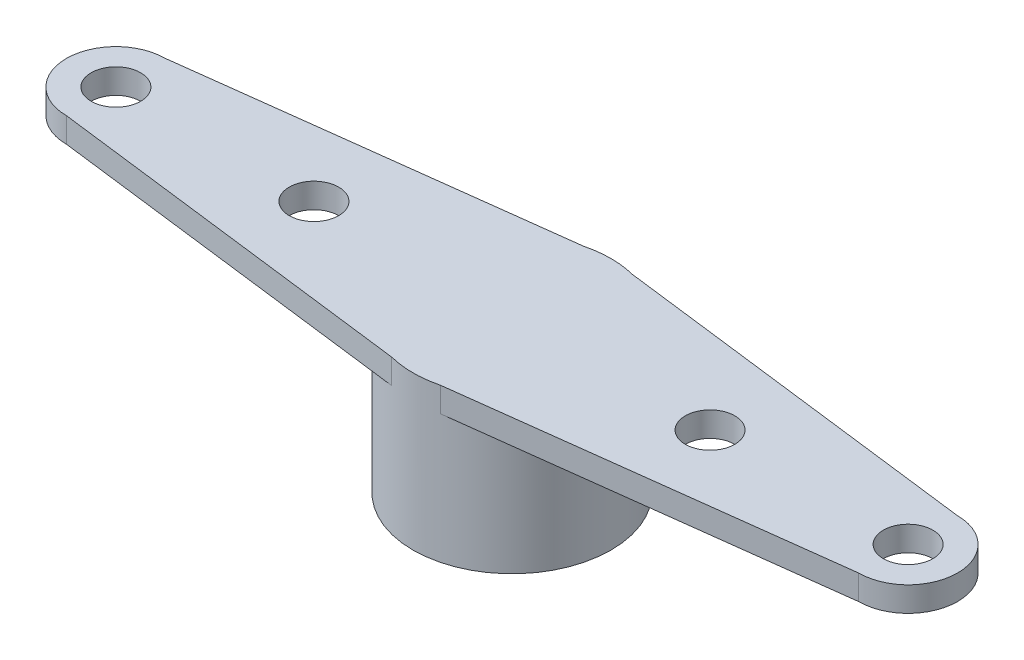
ISO-10303-21;
HEADER;
FILE_DESCRIPTION(('STEP AP214'),'2;1');
FILE_NAME('part.step','',(''),(''),'','','');
FILE_SCHEMA(('AUTOMOTIVE_DESIGN { 1 0 10303 214 1 1 1 1 }'));
ENDSEC;
DATA;
#1=APPLICATION_CONTEXT('core data for automotive mechanical design processes');
#2=APPLICATION_PROTOCOL_DEFINITION('international standard','automotive_design',2000,#1);
#3=PRODUCT_CONTEXT('',#1,'mechanical');
#4=PRODUCT('Part','Part','',(#3));
#5=PRODUCT_RELATED_PRODUCT_CATEGORY('part','',(#4));
#6=PRODUCT_DEFINITION_FORMATION('','',#4);
#7=PRODUCT_DEFINITION_CONTEXT('part definition',#1,'design');
#8=PRODUCT_DEFINITION('design','',#6,#7);
#9=PRODUCT_DEFINITION_SHAPE('','',#8);
#10=(LENGTH_UNIT() NAMED_UNIT(*) SI_UNIT(.MILLI.,.METRE.));
#11=(NAMED_UNIT(*) PLANE_ANGLE_UNIT() SI_UNIT($,.RADIAN.));
#12=(NAMED_UNIT(*) SI_UNIT($,.STERADIAN.) SOLID_ANGLE_UNIT());
#13=UNCERTAINTY_MEASURE_WITH_UNIT(LENGTH_MEASURE(1.E-05),#10,'distance_accuracy_value','');
#14=(GEOMETRIC_REPRESENTATION_CONTEXT(3) GLOBAL_UNCERTAINTY_ASSIGNED_CONTEXT((#13)) GLOBAL_UNIT_ASSIGNED_CONTEXT((#10,
#11,#12)) REPRESENTATION_CONTEXT('',''));
#15=CARTESIAN_POINT('',(0.,0.,0.));
#16=DIRECTION('',(0.,0.,1.));
#17=DIRECTION('',(1.,0.,0.));
#18=AXIS2_PLACEMENT_3D('',#15,#16,#17);
#19=CARTESIAN_POINT('',(0.,0.,0.));
#20=DIRECTION('',(0.,1.,0.));
#21=DIRECTION('',(0.,0.,1.));
#22=AXIS2_PLACEMENT_3D('',#19,#20,#21);
#23=PLANE('',#22);
#24=CARTESIAN_POINT('',(5.08,0.,0.));
#25=DIRECTION('',(0.,1.,0.));
#26=DIRECTION('',(0.,0.,1.));
#27=AXIS2_PLACEMENT_3D('',#24,#25,#26);
#28=CIRCLE('',#27,0.635);
#29=CARTESIAN_POINT('',(5.08,0.,0.635));
#30=VERTEX_POINT('',#29);
#31=EDGE_CURVE('E184',#30,#30,#28,.T.);
#32=ORIENTED_EDGE('',*,*,#31,.T.);
#33=EDGE_LOOP('',(#32));
#34=FACE_BOUND('',#33,.T.);
#35=CARTESIAN_POINT('',(10.16,0.,0.));
#36=DIRECTION('',(0.,1.,0.));
#37=DIRECTION('',(0.,0.,1.));
#38=AXIS2_PLACEMENT_3D('',#35,#36,#37);
#39=CIRCLE('',#38,0.635000000000001);
#40=CARTESIAN_POINT('',(10.16,0.,0.635000000000001));
#41=VERTEX_POINT('',#40);
#42=EDGE_CURVE('E178',#41,#41,#39,.T.);
#43=ORIENTED_EDGE('',*,*,#42,.T.);
#44=EDGE_LOOP('',(#43));
#45=FACE_BOUND('',#44,.T.);
#46=CARTESIAN_POINT('',(0.,0.,0.));
#47=DIRECTION('',(0.,-1.,0.));
#48=DIRECTION('',(0.,0.,-1.));
#49=AXIS2_PLACEMENT_3D('',#46,#47,#48);
#50=CIRCLE('',#49,2.54);
#51=CARTESIAN_POINT('',(0.625230769230772,0.,-2.46184615384615));
#52=VERTEX_POINT('',#51);
#53=CARTESIAN_POINT('',(0.625230769230784,0.,2.46184615384615));
#54=VERTEX_POINT('',#53);
#55=EDGE_CURVE('E44',#52,#54,#50,.T.);
#56=ORIENTED_EDGE('',*,*,#55,.F.);
#57=DIRECTION('',(-0.992277876713668,0.,-0.124034734589208));
#58=VECTOR('',#57,1.);
#59=CARTESIAN_POINT('',(10.16,0.,-1.27));
#60=LINE('',#59,#58);
#61=CARTESIAN_POINT('',(10.16,0.,-1.26999999999998));
#62=VERTEX_POINT('',#61);
#63=EDGE_CURVE('E128',#62,#52,#60,.T.);
#64=ORIENTED_EDGE('',*,*,#63,.F.);
#65=CARTESIAN_POINT('',(10.16,0.,0.));
#66=DIRECTION('',(0.,1.,0.));
#67=DIRECTION('',(0.,0.,1.));
#68=AXIS2_PLACEMENT_3D('',#65,#66,#67);
#69=CIRCLE('',#68,1.26999999999998);
#70=CARTESIAN_POINT('',(10.16,0.,1.26999999999997));
#71=VERTEX_POINT('',#70);
#72=EDGE_CURVE('E125',#71,#62,#69,.T.);
#73=ORIENTED_EDGE('',*,*,#72,.F.);
#74=DIRECTION('',(0.992277876713667,0.,-0.124034734589212));
#75=VECTOR('',#74,1.);
#76=CARTESIAN_POINT('',(10.16,0.,1.26999999999997));
#77=LINE('',#76,#75);
#78=EDGE_CURVE('E123',#54,#71,#77,.T.);
#79=ORIENTED_EDGE('',*,*,#78,.F.);
#80=EDGE_LOOP('',(#56,#64,#73,#79));
#81=FACE_BOUND('',#80,.T.);
#82=ADVANCED_FACE('F33',(#34,#45,#81),#23,.F.);
#83=CARTESIAN_POINT('',(-5.08,0.,0.));
#84=DIRECTION('',(0.,1.,0.));
#85=DIRECTION('',(0.,0.,-1.));
#86=AXIS2_PLACEMENT_3D('',#83,#84,#85);
#87=CIRCLE('',#86,0.635);
#88=CARTESIAN_POINT('',(-5.08,0.,-0.635));
#89=VERTEX_POINT('',#88);
#90=EDGE_CURVE('E196',#89,#89,#87,.T.);
#91=ORIENTED_EDGE('',*,*,#90,.T.);
#92=EDGE_LOOP('',(#91));
#93=FACE_BOUND('',#92,.T.);
#94=CARTESIAN_POINT('',(-10.16,0.,0.));
#95=DIRECTION('',(0.,1.,0.));
#96=DIRECTION('',(0.,0.,-1.));
#97=AXIS2_PLACEMENT_3D('',#94,#95,#96);
#98=CIRCLE('',#97,0.635000000000001);
#99=CARTESIAN_POINT('',(-10.16,0.,-0.635000000000001));
#100=VERTEX_POINT('',#99);
#101=EDGE_CURVE('E190',#100,#100,#98,.T.);
#102=ORIENTED_EDGE('',*,*,#101,.T.);
#103=EDGE_LOOP('',(#102));
#104=FACE_BOUND('',#103,.T.);
#105=CARTESIAN_POINT('',(-0.625230769230784,0.,2.46184615384615));
#106=VERTEX_POINT('',#105);
#107=CARTESIAN_POINT('',(-0.625230769230771,0.,-2.46184615384615));
#108=VERTEX_POINT('',#107);
#109=EDGE_CURVE('E11',#106,#108,#50,.T.);
#110=ORIENTED_EDGE('',*,*,#109,.F.);
#111=DIRECTION('',(0.992277876713667,0.,0.124034734589212));
#112=VECTOR('',#111,1.);
#113=CARTESIAN_POINT('',(-10.16,0.,1.26999999999997));
#114=LINE('',#113,#112);
#115=CARTESIAN_POINT('',(-10.16,0.,1.26999999999998));
#116=VERTEX_POINT('',#115);
#117=EDGE_CURVE('E133',#116,#106,#114,.T.);
#118=ORIENTED_EDGE('',*,*,#117,.F.);
#119=CARTESIAN_POINT('',(-10.16,0.,0.));
#120=DIRECTION('',(0.,1.,0.));
#121=DIRECTION('',(0.,0.,-1.));
#122=AXIS2_PLACEMENT_3D('',#119,#120,#121);
#123=CIRCLE('',#122,1.26999999999998);
#124=CARTESIAN_POINT('',(-10.16,0.,-1.27));
#125=VERTEX_POINT('',#124);
#126=EDGE_CURVE('E79',#125,#116,#123,.T.);
#127=ORIENTED_EDGE('',*,*,#126,.F.);
#128=DIRECTION('',(-0.992277876713668,0.,0.124034734589208));
#129=VECTOR('',#128,1.);
#130=CARTESIAN_POINT('',(-10.16,0.,-1.27));
#131=LINE('',#130,#129);
#132=EDGE_CURVE('E72',#108,#125,#131,.T.);
#133=ORIENTED_EDGE('',*,*,#132,.F.);
#134=EDGE_LOOP('',(#110,#118,#127,#133));
#135=FACE_BOUND('',#134,.T.);
#136=ADVANCED_FACE('F232',(#93,#104,#135),#23,.F.);
#137=CARTESIAN_POINT('',(0.,0.635,0.));
#138=DIRECTION('',(0.,1.,0.));
#139=DIRECTION('',(0.,0.,1.));
#140=AXIS2_PLACEMENT_3D('',#137,#138,#139);
#141=PLANE('',#140);
#142=CARTESIAN_POINT('',(-10.16,0.635,0.));
#143=DIRECTION('',(0.,1.,0.));
#144=DIRECTION('',(0.,0.,-1.));
#145=AXIS2_PLACEMENT_3D('',#142,#143,#144);
#146=CIRCLE('',#145,0.635000000000001);
#147=CARTESIAN_POINT('',(-10.16,0.635,-0.635000000000001));
#148=VERTEX_POINT('',#147);
#149=EDGE_CURVE('E187',#148,#148,#146,.T.);
#150=ORIENTED_EDGE('',*,*,#149,.F.);
#151=EDGE_LOOP('',(#150));
#152=FACE_BOUND('',#151,.T.);
#153=CARTESIAN_POINT('',(10.16,0.635,0.));
#154=DIRECTION('',(0.,1.,0.));
#155=DIRECTION('',(0.,0.,1.));
#156=AXIS2_PLACEMENT_3D('',#153,#154,#155);
#157=CIRCLE('',#156,0.635000000000001);
#158=CARTESIAN_POINT('',(10.16,0.635,0.635000000000001));
#159=VERTEX_POINT('',#158);
#160=EDGE_CURVE('E126',#159,#159,#157,.T.);
#161=ORIENTED_EDGE('',*,*,#160,.F.);
#162=EDGE_LOOP('',(#161));
#163=FACE_BOUND('',#162,.T.);
#164=CARTESIAN_POINT('',(0.,0.635,0.));
#165=DIRECTION('',(0.,1.,0.));
#166=DIRECTION('',(0.,0.,1.));
#167=AXIS2_PLACEMENT_3D('',#164,#165,#166);
#168=CIRCLE('',#167,2.54);
#169=CARTESIAN_POINT('',(-0.625230769230784,0.635,2.46184615384615));
#170=VERTEX_POINT('',#169);
#171=CARTESIAN_POINT('',(0.625230769230784,0.635,2.46184615384615));
#172=VERTEX_POINT('',#171);
#173=EDGE_CURVE('E136',#170,#172,#168,.T.);
#174=ORIENTED_EDGE('',*,*,#173,.T.);
#175=DIRECTION('',(0.992277876713667,0.,-0.124034734589212));
#176=VECTOR('',#175,1.);
#177=CARTESIAN_POINT('',(10.16,0.635,1.26999999999997));
#178=LINE('',#177,#176);
#179=CARTESIAN_POINT('',(10.16,0.635,1.26999999999997));
#180=VERTEX_POINT('',#179);
#181=EDGE_CURVE('E88',#172,#180,#178,.T.);
#182=ORIENTED_EDGE('',*,*,#181,.T.);
#183=CARTESIAN_POINT('',(10.16,0.635,0.));
#184=DIRECTION('',(0.,1.,0.));
#185=DIRECTION('',(0.,0.,1.));
#186=AXIS2_PLACEMENT_3D('',#183,#184,#185);
#187=CIRCLE('',#186,1.26999999999998);
#188=CARTESIAN_POINT('',(10.16,0.635,-1.26999999999998));
#189=VERTEX_POINT('',#188);
#190=EDGE_CURVE('E172',#180,#189,#187,.T.);
#191=ORIENTED_EDGE('',*,*,#190,.T.);
#192=DIRECTION('',(-0.992277876713668,0.,-0.124034734589208));
#193=VECTOR('',#192,1.);
#194=CARTESIAN_POINT('',(10.16,0.635,-1.27));
#195=LINE('',#194,#193);
#196=CARTESIAN_POINT('',(0.625230769230772,0.635,-2.46184615384615));
#197=VERTEX_POINT('',#196);
#198=EDGE_CURVE('E171',#189,#197,#195,.T.);
#199=ORIENTED_EDGE('',*,*,#198,.T.);
#200=CARTESIAN_POINT('',(0.,0.635,0.));
#201=DIRECTION('',(0.,1.,0.));
#202=DIRECTION('',(0.,0.,1.));
#203=AXIS2_PLACEMENT_3D('',#200,#201,#202);
#204=CIRCLE('',#203,2.54);
#205=CARTESIAN_POINT('',(-0.625230769230771,0.635,-2.46184615384615));
#206=VERTEX_POINT('',#205);
#207=EDGE_CURVE('E109',#197,#206,#204,.T.);
#208=ORIENTED_EDGE('',*,*,#207,.T.);
#209=DIRECTION('',(-0.992277876713668,0.,0.124034734589208));
#210=VECTOR('',#209,1.);
#211=CARTESIAN_POINT('',(-10.16,0.635,-1.27));
#212=LINE('',#211,#210);
#213=CARTESIAN_POINT('',(-10.16,0.635,-1.27));
#214=VERTEX_POINT('',#213);
#215=EDGE_CURVE('E103',#206,#214,#212,.T.);
#216=ORIENTED_EDGE('',*,*,#215,.T.);
#217=CARTESIAN_POINT('',(-10.16,0.635,0.));
#218=DIRECTION('',(0.,1.,0.));
#219=DIRECTION('',(0.,0.,-1.));
#220=AXIS2_PLACEMENT_3D('',#217,#218,#219);
#221=CIRCLE('',#220,1.26999999999998);
#222=CARTESIAN_POINT('',(-10.16,0.635,1.26999999999998));
#223=VERTEX_POINT('',#222);
#224=EDGE_CURVE('E107',#214,#223,#221,.T.);
#225=ORIENTED_EDGE('',*,*,#224,.T.);
#226=DIRECTION('',(0.992277876713667,0.,0.124034734589212));
#227=VECTOR('',#226,1.);
#228=CARTESIAN_POINT('',(-10.16,0.635,1.26999999999997));
#229=LINE('',#228,#227);
#230=EDGE_CURVE('E52',#223,#170,#229,.T.);
#231=ORIENTED_EDGE('',*,*,#230,.T.);
#232=EDGE_LOOP('',(#174,#182,#191,#199,#208,#216,#225,#231));
#233=FACE_BOUND('',#232,.T.);
#234=CARTESIAN_POINT('',(5.08,0.635,0.));
#235=DIRECTION('',(0.,1.,0.));
#236=DIRECTION('',(0.,0.,1.));
#237=AXIS2_PLACEMENT_3D('',#234,#235,#236);
#238=CIRCLE('',#237,0.635);
#239=CARTESIAN_POINT('',(5.08,0.635,0.635));
#240=VERTEX_POINT('',#239);
#241=EDGE_CURVE('E181',#240,#240,#238,.T.);
#242=ORIENTED_EDGE('',*,*,#241,.F.);
#243=EDGE_LOOP('',(#242));
#244=FACE_BOUND('',#243,.T.);
#245=CARTESIAN_POINT('',(-5.08,0.635,0.));
#246=DIRECTION('',(0.,1.,0.));
#247=DIRECTION('',(0.,0.,-1.));
#248=AXIS2_PLACEMENT_3D('',#245,#246,#247);
#249=CIRCLE('',#248,0.635);
#250=CARTESIAN_POINT('',(-5.08,0.635,-0.635));
#251=VERTEX_POINT('',#250);
#252=EDGE_CURVE('E193',#251,#251,#249,.T.);
#253=ORIENTED_EDGE('',*,*,#252,.F.);
#254=EDGE_LOOP('',(#253));
#255=FACE_BOUND('',#254,.T.);
#256=ADVANCED_FACE('F104',(#152,#163,#233,#244,#255),#141,.T.);
#257=CARTESIAN_POINT('',(10.16,0.635,1.26999999999997));
#258=DIRECTION('',(-0.124034734589212,0.,-0.992277876713667));
#259=DIRECTION('',(-0.992277876713667,0.,0.124034734589212));
#260=AXIS2_PLACEMENT_3D('',#257,#258,#259);
#261=PLANE('',#260);
#262=ORIENTED_EDGE('',*,*,#78,.T.);
#263=DIRECTION('',(0.,-1.,0.));
#264=VECTOR('',#263,1.);
#265=CARTESIAN_POINT('',(10.16,0.635,1.26999999999997));
#266=LINE('',#265,#264);
#267=EDGE_CURVE('E146',#180,#71,#266,.T.);
#268=ORIENTED_EDGE('',*,*,#267,.F.);
#269=ORIENTED_EDGE('',*,*,#181,.F.);
#270=DIRECTION('',(0.,-1.,0.));
#271=VECTOR('',#270,1.);
#272=CARTESIAN_POINT('',(0.625230769230784,0.635,2.46184615384615));
#273=LINE('',#272,#271);
#274=EDGE_CURVE('E37',#172,#54,#273,.T.);
#275=ORIENTED_EDGE('',*,*,#274,.T.);
#276=EDGE_LOOP('',(#262,#268,#269,#275));
#277=FACE_BOUND('',#276,.T.);
#278=ADVANCED_FACE('F35',(#277),#261,.F.);
#279=CARTESIAN_POINT('',(10.16,0.635,0.));
#280=DIRECTION('',(0.,-1.,0.));
#281=DIRECTION('',(0.,0.,-1.));
#282=AXIS2_PLACEMENT_3D('',#279,#280,#281);
#283=CYLINDRICAL_SURFACE('',#282,1.26999999999998);
#284=ORIENTED_EDGE('',*,*,#72,.T.);
#285=DIRECTION('',(0.,-1.,0.));
#286=VECTOR('',#285,1.);
#287=CARTESIAN_POINT('',(10.16,0.635,-1.26999999999998));
#288=LINE('',#287,#286);
#289=EDGE_CURVE('E144',#189,#62,#288,.T.);
#290=ORIENTED_EDGE('',*,*,#289,.F.);
#291=ORIENTED_EDGE('',*,*,#190,.F.);
#292=ORIENTED_EDGE('',*,*,#267,.T.);
#293=EDGE_LOOP('',(#284,#290,#291,#292));
#294=FACE_BOUND('',#293,.T.);
#295=ADVANCED_FACE('F167',(#294),#283,.T.);
#296=CARTESIAN_POINT('',(10.16,0.635,-1.27));
#297=DIRECTION('',(-0.124034734589208,0.,0.992277876713668));
#298=DIRECTION('',(0.992277876713668,0.,0.124034734589208));
#299=AXIS2_PLACEMENT_3D('',#296,#297,#298);
#300=PLANE('',#299);
#301=ORIENTED_EDGE('',*,*,#63,.T.);
#302=DIRECTION('',(0.,-1.,0.));
#303=VECTOR('',#302,1.);
#304=CARTESIAN_POINT('',(0.625230769230772,0.635,-2.46184615384615));
#305=LINE('',#304,#303);
#306=EDGE_CURVE('E141',#197,#52,#305,.T.);
#307=ORIENTED_EDGE('',*,*,#306,.F.);
#308=ORIENTED_EDGE('',*,*,#198,.F.);
#309=ORIENTED_EDGE('',*,*,#289,.T.);
#310=EDGE_LOOP('',(#301,#307,#308,#309));
#311=FACE_BOUND('',#310,.T.);
#312=ADVANCED_FACE('F170',(#311),#300,.F.);
#313=CARTESIAN_POINT('',(0.,0.635,0.));
#314=DIRECTION('',(0.,-1.,0.));
#315=DIRECTION('',(0.,0.,-1.));
#316=AXIS2_PLACEMENT_3D('',#313,#314,#315);
#317=CYLINDRICAL_SURFACE('',#316,2.54);
#318=ORIENTED_EDGE('',*,*,#306,.T.);
#319=ORIENTED_EDGE('',*,*,#55,.T.);
#320=ORIENTED_EDGE('',*,*,#274,.F.);
#321=ORIENTED_EDGE('',*,*,#173,.F.);
#322=DIRECTION('',(0.,-1.,0.));
#323=VECTOR('',#322,1.);
#324=CARTESIAN_POINT('',(-0.625230769230784,0.635,2.46184615384615));
#325=LINE('',#324,#323);
#326=EDGE_CURVE('E119',#170,#106,#325,.T.);
#327=ORIENTED_EDGE('',*,*,#326,.T.);
#328=ORIENTED_EDGE('',*,*,#109,.T.);
#329=DIRECTION('',(0.,-1.,0.));
#330=VECTOR('',#329,1.);
#331=CARTESIAN_POINT('',(-0.625230769230771,0.635,-2.46184615384615));
#332=LINE('',#331,#330);
#333=EDGE_CURVE('E114',#206,#108,#332,.T.);
#334=ORIENTED_EDGE('',*,*,#333,.F.);
#335=ORIENTED_EDGE('',*,*,#207,.F.);
#336=EDGE_LOOP('',(#318,#319,#320,#321,#327,#328,#334,#335));
#337=FACE_BOUND('',#336,.T.);
#338=CARTESIAN_POINT('',(0.,-3.302,0.));
#339=DIRECTION('',(0.,-1.,0.));
#340=DIRECTION('',(0.,0.,-1.));
#341=AXIS2_PLACEMENT_3D('',#338,#339,#340);
#342=CIRCLE('',#341,2.54);
#343=CARTESIAN_POINT('',(0.,-3.302,-2.54));
#344=VERTEX_POINT('',#343);
#345=EDGE_CURVE('E164',#344,#344,#342,.T.);
#346=ORIENTED_EDGE('',*,*,#345,.F.);
#347=EDGE_LOOP('',(#346));
#348=FACE_BOUND('',#347,.T.);
#349=ADVANCED_FACE('F158',(#337,#348),#317,.T.);
#350=CARTESIAN_POINT('',(-10.16,0.635,-1.27));
#351=DIRECTION('',(0.124034734589208,0.,0.992277876713668));
#352=DIRECTION('',(0.992277876713668,0.,-0.124034734589208));
#353=AXIS2_PLACEMENT_3D('',#350,#351,#352);
#354=PLANE('',#353);
#355=ORIENTED_EDGE('',*,*,#132,.T.);
#356=DIRECTION('',(0.,-1.,0.));
#357=VECTOR('',#356,1.);
#358=CARTESIAN_POINT('',(-10.16,0.635,-1.27));
#359=LINE('',#358,#357);
#360=EDGE_CURVE('E112',#214,#125,#359,.T.);
#361=ORIENTED_EDGE('',*,*,#360,.F.);
#362=ORIENTED_EDGE('',*,*,#215,.F.);
#363=ORIENTED_EDGE('',*,*,#333,.T.);
#364=EDGE_LOOP('',(#355,#361,#362,#363));
#365=FACE_BOUND('',#364,.T.);
#366=ADVANCED_FACE('F113',(#365),#354,.F.);
#367=CARTESIAN_POINT('',(-10.16,0.635,0.));
#368=DIRECTION('',(0.,-1.,0.));
#369=DIRECTION('',(0.,0.,-1.));
#370=AXIS2_PLACEMENT_3D('',#367,#368,#369);
#371=CYLINDRICAL_SURFACE('',#370,1.26999999999998);
#372=ORIENTED_EDGE('',*,*,#126,.T.);
#373=DIRECTION('',(0.,-1.,0.));
#374=VECTOR('',#373,1.);
#375=CARTESIAN_POINT('',(-10.16,0.635,1.26999999999998));
#376=LINE('',#375,#374);
#377=EDGE_CURVE('E115',#223,#116,#376,.T.);
#378=ORIENTED_EDGE('',*,*,#377,.F.);
#379=ORIENTED_EDGE('',*,*,#224,.F.);
#380=ORIENTED_EDGE('',*,*,#360,.T.);
#381=EDGE_LOOP('',(#372,#378,#379,#380));
#382=FACE_BOUND('',#381,.T.);
#383=ADVANCED_FACE('F117',(#382),#371,.T.);
#384=CARTESIAN_POINT('',(-10.16,0.635,1.26999999999997));
#385=DIRECTION('',(0.124034734589212,0.,-0.992277876713667));
#386=DIRECTION('',(-0.992277876713667,0.,-0.124034734589212));
#387=AXIS2_PLACEMENT_3D('',#384,#385,#386);
#388=PLANE('',#387);
#389=ORIENTED_EDGE('',*,*,#117,.T.);
#390=ORIENTED_EDGE('',*,*,#326,.F.);
#391=ORIENTED_EDGE('',*,*,#230,.F.);
#392=ORIENTED_EDGE('',*,*,#377,.T.);
#393=EDGE_LOOP('',(#389,#390,#391,#392));
#394=FACE_BOUND('',#393,.T.);
#395=ADVANCED_FACE('F243',(#394),#388,.F.);
#396=CARTESIAN_POINT('',(10.16,0.635,0.));
#397=DIRECTION('',(0.,-1.,0.));
#398=DIRECTION('',(0.,0.,-1.));
#399=AXIS2_PLACEMENT_3D('',#396,#397,#398);
#400=CYLINDRICAL_SURFACE('',#399,0.635000000000001);
#401=ORIENTED_EDGE('',*,*,#160,.T.);
#402=EDGE_LOOP('',(#401));
#403=FACE_BOUND('',#402,.T.);
#404=ORIENTED_EDGE('',*,*,#42,.F.);
#405=EDGE_LOOP('',(#404));
#406=FACE_BOUND('',#405,.T.);
#407=ADVANCED_FACE('F246',(#403,#406),#400,.F.);
#408=CARTESIAN_POINT('',(5.08,0.635,0.));
#409=DIRECTION('',(0.,-1.,0.));
#410=DIRECTION('',(0.,0.,-1.));
#411=AXIS2_PLACEMENT_3D('',#408,#409,#410);
#412=CYLINDRICAL_SURFACE('',#411,0.635);
#413=ORIENTED_EDGE('',*,*,#241,.T.);
#414=EDGE_LOOP('',(#413));
#415=FACE_BOUND('',#414,.T.);
#416=ORIENTED_EDGE('',*,*,#31,.F.);
#417=EDGE_LOOP('',(#416));
#418=FACE_BOUND('',#417,.T.);
#419=ADVANCED_FACE('F265',(#415,#418),#412,.F.);
#420=CARTESIAN_POINT('',(-10.16,0.635,0.));
#421=DIRECTION('',(0.,-1.,0.));
#422=DIRECTION('',(0.,0.,-1.));
#423=AXIS2_PLACEMENT_3D('',#420,#421,#422);
#424=CYLINDRICAL_SURFACE('',#423,0.635000000000001);
#425=ORIENTED_EDGE('',*,*,#149,.T.);
#426=EDGE_LOOP('',(#425));
#427=FACE_BOUND('',#426,.T.);
#428=ORIENTED_EDGE('',*,*,#101,.F.);
#429=EDGE_LOOP('',(#428));
#430=FACE_BOUND('',#429,.T.);
#431=ADVANCED_FACE('F272',(#427,#430),#424,.F.);
#432=CARTESIAN_POINT('',(-5.08,0.635,0.));
#433=DIRECTION('',(0.,-1.,0.));
#434=DIRECTION('',(0.,0.,-1.));
#435=AXIS2_PLACEMENT_3D('',#432,#433,#434);
#436=CYLINDRICAL_SURFACE('',#435,0.635);
#437=ORIENTED_EDGE('',*,*,#252,.T.);
#438=EDGE_LOOP('',(#437));
#439=FACE_BOUND('',#438,.T.);
#440=ORIENTED_EDGE('',*,*,#90,.F.);
#441=EDGE_LOOP('',(#440));
#442=FACE_BOUND('',#441,.T.);
#443=ADVANCED_FACE('F220',(#439,#442),#436,.F.);
#444=CARTESIAN_POINT('',(0.,-3.302,0.));
#445=DIRECTION('',(0.,-1.,0.));
#446=DIRECTION('',(0.,0.,-1.));
#447=AXIS2_PLACEMENT_3D('',#444,#445,#446);
#448=PLANE('',#447);
#449=CARTESIAN_POINT('',(0.,-3.302,0.));
#450=DIRECTION('',(0.,-1.,0.));
#451=DIRECTION('',(0.,0.,-1.));
#452=AXIS2_PLACEMENT_3D('',#449,#450,#451);
#453=CIRCLE('',#452,2.286);
#454=CARTESIAN_POINT('',(0.,-3.302,-2.286));
#455=VERTEX_POINT('',#454);
#456=EDGE_CURVE('E203',#455,#455,#453,.T.);
#457=ORIENTED_EDGE('',*,*,#456,.F.);
#458=EDGE_LOOP('',(#457));
#459=FACE_BOUND('',#458,.T.);
#460=ORIENTED_EDGE('',*,*,#345,.T.);
#461=EDGE_LOOP('',(#460));
#462=FACE_BOUND('',#461,.T.);
#463=ADVANCED_FACE('F214',(#459,#462),#448,.T.);
#464=CARTESIAN_POINT('',(0.,0.,0.));
#465=DIRECTION('',(0.,-1.,0.));
#466=DIRECTION('',(0.,0.,-1.));
#467=AXIS2_PLACEMENT_3D('',#464,#465,#466);
#468=CYLINDRICAL_SURFACE('',#467,2.286);
#469=CARTESIAN_POINT('',(0.,0.,0.));
#470=DIRECTION('',(0.,-1.,0.));
#471=DIRECTION('',(0.,0.,-1.));
#472=AXIS2_PLACEMENT_3D('',#469,#470,#471);
#473=CIRCLE('',#472,2.286);
#474=CARTESIAN_POINT('',(0.,0.,-2.286));
#475=VERTEX_POINT('',#474);
#476=EDGE_CURVE('E165',#475,#475,#473,.T.);
#477=ORIENTED_EDGE('',*,*,#476,.F.);
#478=EDGE_LOOP('',(#477));
#479=FACE_BOUND('',#478,.T.);
#480=ORIENTED_EDGE('',*,*,#456,.T.);
#481=EDGE_LOOP('',(#480));
#482=FACE_BOUND('',#481,.T.);
#483=ADVANCED_FACE('F211',(#479,#482),#468,.F.);
#484=CARTESIAN_POINT('',(0.,0.,0.));
#485=DIRECTION('',(0.,-1.,0.));
#486=DIRECTION('',(0.,0.,-1.));
#487=AXIS2_PLACEMENT_3D('',#484,#485,#486);
#488=PLANE('',#487);
#489=ORIENTED_EDGE('',*,*,#476,.T.);
#490=EDGE_LOOP('',(#489));
#491=FACE_BOUND('',#490,.T.);
#492=ADVANCED_FACE('F209',(#491),#488,.T.);
#493=CLOSED_SHELL('',(#82,#136,#256,#278,#295,#312,#349,#366,#383,#395,#407,#419,#431,#443,#463,
#483,#492));
#494=MANIFOLD_SOLID_BREP('B2',#493);
#495=ADVANCED_BREP_SHAPE_REPRESENTATION('',(#18,#494),#14);
#496=SHAPE_DEFINITION_REPRESENTATION(#9,#495);
ENDSEC;
END-ISO-10303-21;
